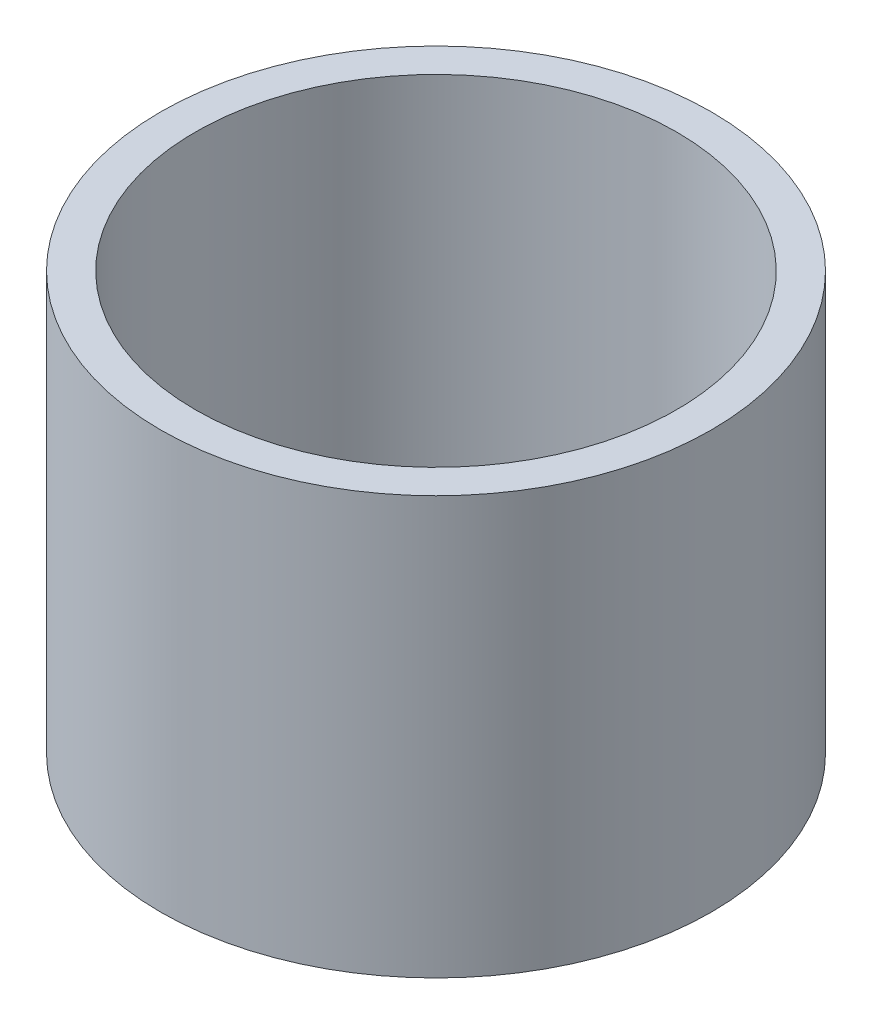
ISO-10303-21;
HEADER;
FILE_DESCRIPTION(('STEP AP214'),'2;1');
FILE_NAME('part.step','',(''),(''),'','','');
FILE_SCHEMA(('AUTOMOTIVE_DESIGN { 1 0 10303 214 1 1 1 1 }'));
ENDSEC;
DATA;
#1=APPLICATION_CONTEXT('core data for automotive mechanical design processes');
#2=APPLICATION_PROTOCOL_DEFINITION('international standard','automotive_design',2000,#1);
#3=PRODUCT_CONTEXT('',#1,'mechanical');
#4=PRODUCT('Part','Part','',(#3));
#5=PRODUCT_RELATED_PRODUCT_CATEGORY('part','',(#4));
#6=PRODUCT_DEFINITION_FORMATION('','',#4);
#7=PRODUCT_DEFINITION_CONTEXT('part definition',#1,'design');
#8=PRODUCT_DEFINITION('design','',#6,#7);
#9=PRODUCT_DEFINITION_SHAPE('','',#8);
#10=(LENGTH_UNIT() NAMED_UNIT(*) SI_UNIT(.MILLI.,.METRE.));
#11=(NAMED_UNIT(*) PLANE_ANGLE_UNIT() SI_UNIT($,.RADIAN.));
#12=(NAMED_UNIT(*) SI_UNIT($,.STERADIAN.) SOLID_ANGLE_UNIT());
#13=UNCERTAINTY_MEASURE_WITH_UNIT(LENGTH_MEASURE(1.E-05),#10,'distance_accuracy_value','');
#14=(GEOMETRIC_REPRESENTATION_CONTEXT(3) GLOBAL_UNCERTAINTY_ASSIGNED_CONTEXT((#13)) GLOBAL_UNIT_ASSIGNED_CONTEXT((#10,
#11,#12)) REPRESENTATION_CONTEXT('',''));
#15=CARTESIAN_POINT('',(0.,0.,0.));
#16=DIRECTION('',(0.,0.,1.));
#17=DIRECTION('',(1.,0.,0.));
#18=AXIS2_PLACEMENT_3D('',#15,#16,#17);
#19=CARTESIAN_POINT('',(0.,76.2,0.));
#20=DIRECTION('',(0.,1.,0.));
#21=DIRECTION('',(0.,0.,1.));
#22=AXIS2_PLACEMENT_3D('',#19,#20,#21);
#23=PLANE('',#22);
#24=CARTESIAN_POINT('',(0.,76.2,0.));
#25=DIRECTION('',(0.,1.,0.));
#26=DIRECTION('',(0.,0.,1.));
#27=AXIS2_PLACEMENT_3D('',#24,#25,#26);
#28=CIRCLE('',#27,50.2539);
#29=CARTESIAN_POINT('',(0.,76.2,50.2539));
#30=VERTEX_POINT('',#29);
#31=EDGE_CURVE('E10',#30,#30,#28,.T.);
#32=ORIENTED_EDGE('',*,*,#31,.T.);
#33=EDGE_LOOP('',(#32));
#34=FACE_BOUND('',#33,.T.);
#35=CARTESIAN_POINT('',(0.,76.2,0.));
#36=DIRECTION('',(0.,1.,0.));
#37=DIRECTION('',(0.,0.,1.));
#38=AXIS2_PLACEMENT_3D('',#35,#36,#37);
#39=CIRCLE('',#38,43.9039);
#40=CARTESIAN_POINT('',(0.,76.2,43.9039));
#41=VERTEX_POINT('',#40);
#42=EDGE_CURVE('E49',#41,#41,#39,.T.);
#43=ORIENTED_EDGE('',*,*,#42,.F.);
#44=EDGE_LOOP('',(#43));
#45=FACE_BOUND('',#44,.T.);
#46=ADVANCED_FACE('F38',(#34,#45),#23,.T.);
#47=CARTESIAN_POINT('',(0.,0.,0.));
#48=DIRECTION('',(0.,1.,0.));
#49=DIRECTION('',(0.,0.,1.));
#50=AXIS2_PLACEMENT_3D('',#47,#48,#49);
#51=PLANE('',#50);
#52=CARTESIAN_POINT('',(0.,0.,0.));
#53=DIRECTION('',(0.,1.,0.));
#54=DIRECTION('',(0.,0.,1.));
#55=AXIS2_PLACEMENT_3D('',#52,#53,#54);
#56=CIRCLE('',#55,50.2539);
#57=CARTESIAN_POINT('',(0.,0.,50.2539));
#58=VERTEX_POINT('',#57);
#59=EDGE_CURVE('E42',#58,#58,#56,.T.);
#60=ORIENTED_EDGE('',*,*,#59,.F.);
#61=EDGE_LOOP('',(#60));
#62=FACE_BOUND('',#61,.T.);
#63=CARTESIAN_POINT('',(0.,0.,0.));
#64=DIRECTION('',(0.,1.,0.));
#65=DIRECTION('',(0.,0.,1.));
#66=AXIS2_PLACEMENT_3D('',#63,#64,#65);
#67=CIRCLE('',#66,43.9039);
#68=CARTESIAN_POINT('',(0.,0.,43.9039));
#69=VERTEX_POINT('',#68);
#70=EDGE_CURVE('E51',#69,#69,#67,.T.);
#71=ORIENTED_EDGE('',*,*,#70,.T.);
#72=EDGE_LOOP('',(#71));
#73=FACE_BOUND('',#72,.T.);
#74=ADVANCED_FACE('F61',(#62,#73),#51,.F.);
#75=CARTESIAN_POINT('',(0.,76.2,0.));
#76=DIRECTION('',(0.,-1.,0.));
#77=DIRECTION('',(0.,0.,-1.));
#78=AXIS2_PLACEMENT_3D('',#75,#76,#77);
#79=CYLINDRICAL_SURFACE('',#78,50.2539);
#80=ORIENTED_EDGE('',*,*,#31,.F.);
#81=EDGE_LOOP('',(#80));
#82=FACE_BOUND('',#81,.T.);
#83=ORIENTED_EDGE('',*,*,#59,.T.);
#84=EDGE_LOOP('',(#83));
#85=FACE_BOUND('',#84,.T.);
#86=ADVANCED_FACE('F40',(#82,#85),#79,.T.);
#87=CARTESIAN_POINT('',(0.,76.2,0.));
#88=DIRECTION('',(0.,-1.,0.));
#89=DIRECTION('',(0.,0.,-1.));
#90=AXIS2_PLACEMENT_3D('',#87,#88,#89);
#91=CYLINDRICAL_SURFACE('',#90,43.9039);
#92=ORIENTED_EDGE('',*,*,#42,.T.);
#93=EDGE_LOOP('',(#92));
#94=FACE_BOUND('',#93,.T.);
#95=ORIENTED_EDGE('',*,*,#70,.F.);
#96=EDGE_LOOP('',(#95));
#97=FACE_BOUND('',#96,.T.);
#98=ADVANCED_FACE('F57',(#94,#97),#91,.F.);
#99=CLOSED_SHELL('',(#46,#74,#86,#98));
#100=MANIFOLD_SOLID_BREP('B2',#99);
#101=ADVANCED_BREP_SHAPE_REPRESENTATION('',(#18,#100),#14);
#102=SHAPE_DEFINITION_REPRESENTATION(#9,#101);
ENDSEC;
END-ISO-10303-21;
